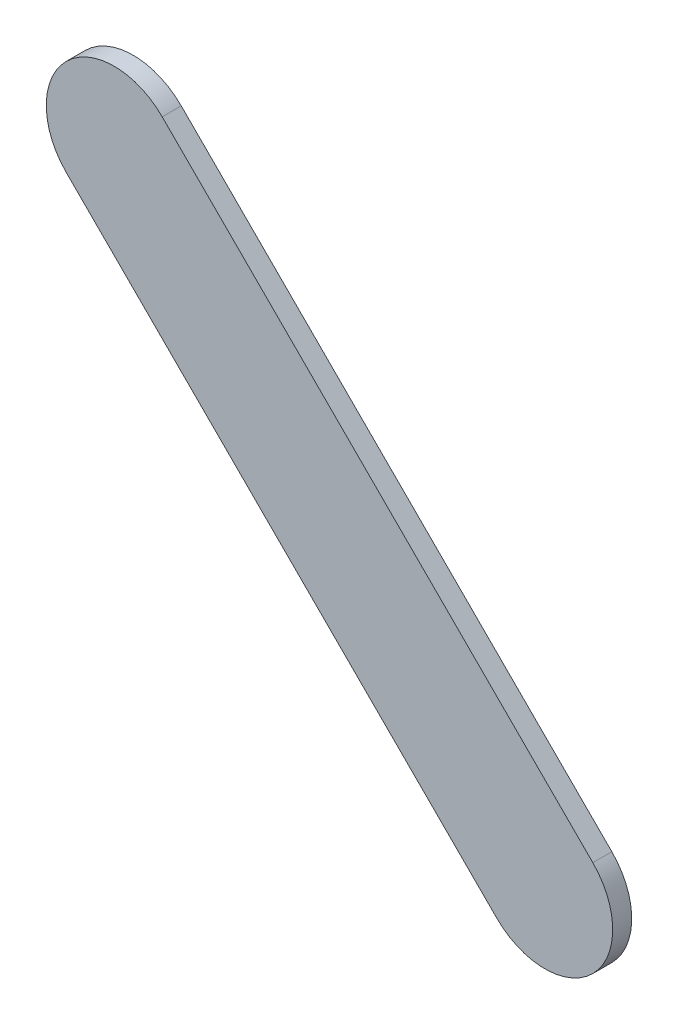
ISO-10303-21;
HEADER;
FILE_DESCRIPTION(('STEP AP214'),'2;1');
FILE_NAME('part.step','',(''),(''),'','','');
FILE_SCHEMA(('AUTOMOTIVE_DESIGN { 1 0 10303 214 1 1 1 1 }'));
ENDSEC;
DATA;
#1=APPLICATION_CONTEXT('core data for automotive mechanical design processes');
#2=APPLICATION_PROTOCOL_DEFINITION('international standard','automotive_design',2000,#1);
#3=PRODUCT_CONTEXT('',#1,'mechanical');
#4=PRODUCT('Part','Part','',(#3));
#5=PRODUCT_RELATED_PRODUCT_CATEGORY('part','',(#4));
#6=PRODUCT_DEFINITION_FORMATION('','',#4);
#7=PRODUCT_DEFINITION_CONTEXT('part definition',#1,'design');
#8=PRODUCT_DEFINITION('design','',#6,#7);
#9=PRODUCT_DEFINITION_SHAPE('','',#8);
#10=(LENGTH_UNIT() NAMED_UNIT(*) SI_UNIT(.MILLI.,.METRE.));
#11=(NAMED_UNIT(*) PLANE_ANGLE_UNIT() SI_UNIT($,.RADIAN.));
#12=(NAMED_UNIT(*) SI_UNIT($,.STERADIAN.) SOLID_ANGLE_UNIT());
#13=UNCERTAINTY_MEASURE_WITH_UNIT(LENGTH_MEASURE(1.E-05),#10,'distance_accuracy_value','');
#14=(GEOMETRIC_REPRESENTATION_CONTEXT(3) GLOBAL_UNCERTAINTY_ASSIGNED_CONTEXT((#13)) GLOBAL_UNIT_ASSIGNED_CONTEXT((#10,
#11,#12)) REPRESENTATION_CONTEXT('',''));
#15=CARTESIAN_POINT('',(0.,0.,0.));
#16=DIRECTION('',(0.,0.,1.));
#17=DIRECTION('',(1.,0.,0.));
#18=AXIS2_PLACEMENT_3D('',#15,#16,#17);
#19=CARTESIAN_POINT('',(87.5312067,92.16745854,0.));
#20=DIRECTION('',(0.707106781186554,0.707106781186541,0.));
#21=DIRECTION('',(0.707106781186541,-0.707106781186554,0.));
#22=AXIS2_PLACEMENT_3D('',#19,#20,#21);
#23=PLANE('',#22);
#24=DIRECTION('',(0.707106781186541,-0.707106781186554,0.));
#25=VECTOR('',#24,1.);
#26=CARTESIAN_POINT('',(87.5312067,92.16745854,0.03556));
#27=LINE('',#26,#25);
#28=CARTESIAN_POINT('',(87.5312067,92.16745854,0.03556));
#29=VERTEX_POINT('',#28);
#30=CARTESIAN_POINT('',(88.33646036,91.36220488,0.03556));
#31=VERTEX_POINT('',#30);
#32=EDGE_CURVE('E11',#29,#31,#27,.T.);
#33=ORIENTED_EDGE('',*,*,#32,.F.);
#34=DIRECTION('',(0.,0.,1.));
#35=VECTOR('',#34,1.);
#36=CARTESIAN_POINT('',(87.5312067,92.16745854,0.));
#37=LINE('',#36,#35);
#38=CARTESIAN_POINT('',(87.5312067,92.16745854,0.));
#39=VERTEX_POINT('',#38);
#40=EDGE_CURVE('E24',#39,#29,#37,.T.);
#41=ORIENTED_EDGE('',*,*,#40,.F.);
#42=DIRECTION('',(0.707106781186541,-0.707106781186554,0.));
#43=VECTOR('',#42,1.);
#44=CARTESIAN_POINT('',(87.5312067,92.16745854,0.));
#45=LINE('',#44,#43);
#46=CARTESIAN_POINT('',(88.33646036,91.36220488,0.));
#47=VERTEX_POINT('',#46);
#48=EDGE_CURVE('E75',#39,#47,#45,.T.);
#49=ORIENTED_EDGE('',*,*,#48,.T.);
#50=DIRECTION('',(0.,0.,1.));
#51=VECTOR('',#50,1.);
#52=CARTESIAN_POINT('',(88.33646036,91.36220488,0.));
#53=LINE('',#52,#51);
#54=EDGE_CURVE('E37',#47,#31,#53,.T.);
#55=ORIENTED_EDGE('',*,*,#54,.T.);
#56=EDGE_LOOP('',(#33,#41,#49,#55));
#57=FACE_BOUND('',#56,.T.);
#58=ADVANCED_FACE('F17',(#57),#23,.F.);
#59=CARTESIAN_POINT('',(88.42626206,91.45200785,0.));
#60=DIRECTION('',(0.,0.,-1.));
#61=DIRECTION('',(-0.707101781156281,-0.707111781181459,0.));
#62=AXIS2_PLACEMENT_3D('',#59,#60,#61);
#63=CYLINDRICAL_SURFACE('',#62,0.126999680092956);
#64=CARTESIAN_POINT('',(88.42626206,91.45200785,0.03556));
#65=DIRECTION('',(0.,0.,1.));
#66=DIRECTION('',(-0.707101781156281,-0.707111781181459,0.));
#67=AXIS2_PLACEMENT_3D('',#64,#65,#66);
#68=CIRCLE('',#67,0.126999680092956);
#69=CARTESIAN_POINT('',(88.51606376,91.54181082,0.03556));
#70=VERTEX_POINT('',#69);
#71=EDGE_CURVE('E83',#31,#70,#68,.T.);
#72=ORIENTED_EDGE('',*,*,#71,.F.);
#73=ORIENTED_EDGE('',*,*,#54,.F.);
#74=CARTESIAN_POINT('',(88.42626206,91.45200785,0.));
#75=DIRECTION('',(0.,0.,1.));
#76=DIRECTION('',(-0.707101781156281,-0.707111781181459,0.));
#77=AXIS2_PLACEMENT_3D('',#74,#75,#76);
#78=CIRCLE('',#77,0.126999680092956);
#79=CARTESIAN_POINT('',(88.51606376,91.54181082,0.));
#80=VERTEX_POINT('',#79);
#81=EDGE_CURVE('E81',#47,#80,#78,.T.);
#82=ORIENTED_EDGE('',*,*,#81,.T.);
#83=DIRECTION('',(0.,0.,1.));
#84=VECTOR('',#83,1.);
#85=CARTESIAN_POINT('',(88.51606376,91.54181082,0.));
#86=LINE('',#85,#84);
#87=EDGE_CURVE('E67',#80,#70,#86,.T.);
#88=ORIENTED_EDGE('',*,*,#87,.T.);
#89=EDGE_LOOP('',(#72,#73,#82,#88));
#90=FACE_BOUND('',#89,.T.);
#91=ADVANCED_FACE('F89',(#90),#63,.T.);
#92=CARTESIAN_POINT('',(88.51606376,91.54181082,0.));
#93=DIRECTION('',(-0.707106781186548,-0.707106781186548,0.));
#94=DIRECTION('',(-0.707106781186548,0.707106781186548,0.));
#95=AXIS2_PLACEMENT_3D('',#92,#93,#94);
#96=PLANE('',#95);
#97=DIRECTION('',(-0.707106781186548,0.707106781186548,0.));
#98=VECTOR('',#97,1.);
#99=CARTESIAN_POINT('',(88.51606376,91.54181082,0.03556));
#100=LINE('',#99,#98);
#101=CARTESIAN_POINT('',(87.71081264,92.34706194,0.03556));
#102=VERTEX_POINT('',#101);
#103=EDGE_CURVE('E71',#70,#102,#100,.T.);
#104=ORIENTED_EDGE('',*,*,#103,.F.);
#105=ORIENTED_EDGE('',*,*,#87,.F.);
#106=DIRECTION('',(-0.707106781186548,0.707106781186548,0.));
#107=VECTOR('',#106,1.);
#108=CARTESIAN_POINT('',(88.51606376,91.54181082,0.));
#109=LINE('',#108,#107);
#110=CARTESIAN_POINT('',(87.71081264,92.34706194,0.));
#111=VERTEX_POINT('',#110);
#112=EDGE_CURVE('E63',#80,#111,#109,.T.);
#113=ORIENTED_EDGE('',*,*,#112,.T.);
#114=DIRECTION('',(0.,0.,1.));
#115=VECTOR('',#114,1.);
#116=CARTESIAN_POINT('',(87.71081264,92.34706194,0.));
#117=LINE('',#116,#115);
#118=EDGE_CURVE('E53',#111,#102,#117,.T.);
#119=ORIENTED_EDGE('',*,*,#118,.T.);
#120=EDGE_LOOP('',(#104,#105,#113,#119));
#121=FACE_BOUND('',#120,.T.);
#122=ADVANCED_FACE('F66',(#121),#96,.F.);
#123=CARTESIAN_POINT('',(87.62100967,92.25726024,0.));
#124=DIRECTION('',(0.,0.,-1.));
#125=DIRECTION('',(0.707111781181403,0.707101781156337,0.));
#126=AXIS2_PLACEMENT_3D('',#123,#124,#125);
#127=CYLINDRICAL_SURFACE('',#126,0.126999680092953);
#128=CARTESIAN_POINT('',(87.62100967,92.25726024,0.03556));
#129=DIRECTION('',(0.,0.,1.));
#130=DIRECTION('',(0.707111781181403,0.707101781156337,0.));
#131=AXIS2_PLACEMENT_3D('',#128,#129,#130);
#132=CIRCLE('',#131,0.126999680092953);
#133=EDGE_CURVE('E59',#102,#29,#132,.T.);
#134=ORIENTED_EDGE('',*,*,#133,.F.);
#135=ORIENTED_EDGE('',*,*,#118,.F.);
#136=CARTESIAN_POINT('',(87.62100967,92.25726024,0.));
#137=DIRECTION('',(0.,0.,1.));
#138=DIRECTION('',(0.707111781181403,0.707101781156337,0.));
#139=AXIS2_PLACEMENT_3D('',#136,#137,#138);
#140=CIRCLE('',#139,0.126999680092953);
#141=EDGE_CURVE('E57',#111,#39,#140,.T.);
#142=ORIENTED_EDGE('',*,*,#141,.T.);
#143=ORIENTED_EDGE('',*,*,#40,.T.);
#144=EDGE_LOOP('',(#134,#135,#142,#143));
#145=FACE_BOUND('',#144,.T.);
#146=ADVANCED_FACE('F55',(#145),#127,.T.);
#147=CARTESIAN_POINT('',(87.5312067,92.16745854,0.));
#148=DIRECTION('',(0.,0.,-1.));
#149=DIRECTION('',(-1.,0.,0.));
#150=AXIS2_PLACEMENT_3D('',#147,#148,#149);
#151=PLANE('',#150);
#152=ORIENTED_EDGE('',*,*,#141,.F.);
#153=ORIENTED_EDGE('',*,*,#112,.F.);
#154=ORIENTED_EDGE('',*,*,#81,.F.);
#155=ORIENTED_EDGE('',*,*,#48,.F.);
#156=EDGE_LOOP('',(#152,#153,#154,#155));
#157=FACE_BOUND('',#156,.T.);
#158=ADVANCED_FACE('F74',(#157),#151,.T.);
#159=CARTESIAN_POINT('',(87.5312067,92.16745854,0.03556));
#160=DIRECTION('',(0.,0.,-1.));
#161=DIRECTION('',(-1.,0.,0.));
#162=AXIS2_PLACEMENT_3D('',#159,#160,#161);
#163=PLANE('',#162);
#164=ORIENTED_EDGE('',*,*,#32,.T.);
#165=ORIENTED_EDGE('',*,*,#71,.T.);
#166=ORIENTED_EDGE('',*,*,#103,.T.);
#167=ORIENTED_EDGE('',*,*,#133,.T.);
#168=EDGE_LOOP('',(#164,#165,#166,#167));
#169=FACE_BOUND('',#168,.T.);
#170=ADVANCED_FACE('F91',(#169),#163,.F.);
#171=CLOSED_SHELL('',(#58,#91,#122,#146,#158,#170));
#172=MANIFOLD_SOLID_BREP('B1',#171);
#173=ADVANCED_BREP_SHAPE_REPRESENTATION('',(#18,#172),#14);
#174=SHAPE_DEFINITION_REPRESENTATION(#9,#173);
ENDSEC;
END-ISO-10303-21;
